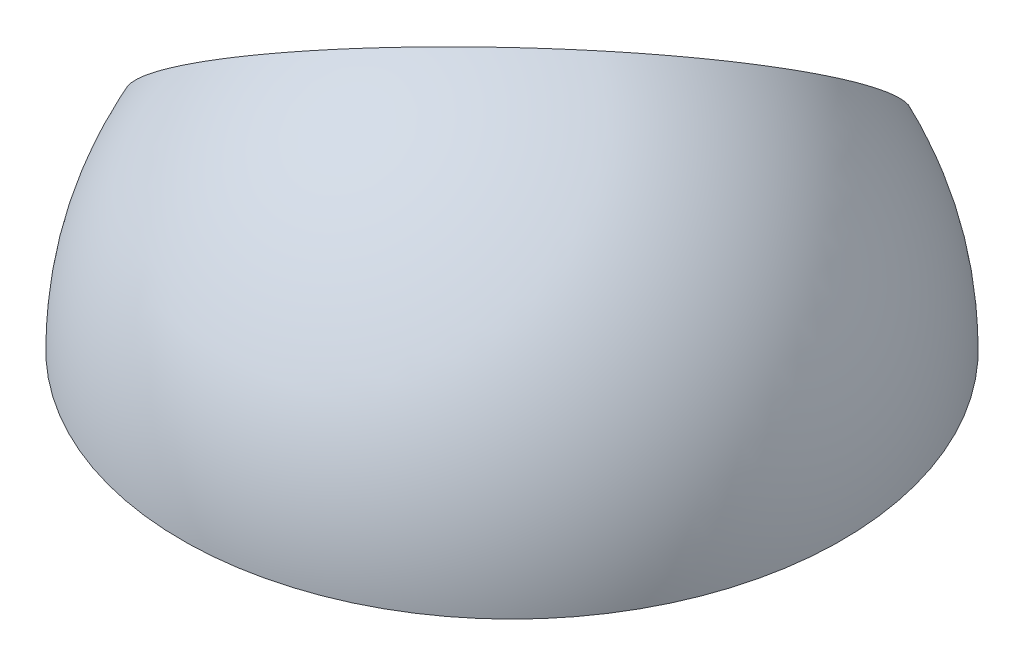
ISO-10303-21;
HEADER;
FILE_DESCRIPTION(('STEP AP214'),'2;1');
FILE_NAME('part.step','',(''),(''),'','','');
FILE_SCHEMA(('AUTOMOTIVE_DESIGN { 1 0 10303 214 1 1 1 1 }'));
ENDSEC;
DATA;
#1=APPLICATION_CONTEXT('core data for automotive mechanical design processes');
#2=APPLICATION_PROTOCOL_DEFINITION('international standard','automotive_design',2000,#1);
#3=PRODUCT_CONTEXT('',#1,'mechanical');
#4=PRODUCT('Part','Part','',(#3));
#5=PRODUCT_RELATED_PRODUCT_CATEGORY('part','',(#4));
#6=PRODUCT_DEFINITION_FORMATION('','',#4);
#7=PRODUCT_DEFINITION_CONTEXT('part definition',#1,'design');
#8=PRODUCT_DEFINITION('design','',#6,#7);
#9=PRODUCT_DEFINITION_SHAPE('','',#8);
#10=(LENGTH_UNIT() NAMED_UNIT(*) SI_UNIT(.MILLI.,.METRE.));
#11=(NAMED_UNIT(*) PLANE_ANGLE_UNIT() SI_UNIT($,.RADIAN.));
#12=(NAMED_UNIT(*) SI_UNIT($,.STERADIAN.) SOLID_ANGLE_UNIT());
#13=UNCERTAINTY_MEASURE_WITH_UNIT(LENGTH_MEASURE(1.E-05),#10,'distance_accuracy_value','');
#14=(GEOMETRIC_REPRESENTATION_CONTEXT(3) GLOBAL_UNCERTAINTY_ASSIGNED_CONTEXT((#13)) GLOBAL_UNIT_ASSIGNED_CONTEXT((#10,
#11,#12)) REPRESENTATION_CONTEXT('',''));
#15=CARTESIAN_POINT('',(0.,0.,0.));
#16=DIRECTION('',(0.,0.,1.));
#17=DIRECTION('',(1.,0.,0.));
#18=AXIS2_PLACEMENT_3D('',#15,#16,#17);
#19=CARTESIAN_POINT('',(0.383136407393772,0.,0.));
#20=DIRECTION('',(0.,-1.,0.));
#21=DIRECTION('',(0.,0.,-1.));
#22=AXIS2_PLACEMENT_3D('',#19,#20,#21);
#23=DEGENERATE_TOROIDAL_SURFACE('',#22,0.383136407393772,126.5,.F.);
#24=CARTESIAN_POINT('',(52.6351043958338,-86.6907653224554,75.4072090776001));
#25=CARTESIAN_POINT('',(52.581622733901,-86.6827571855285,75.4534362434314));
#26=CARTESIAN_POINT('',(52.531166621759,-86.6703634438254,75.5024869214113));
#27=CARTESIAN_POINT('',(52.4377720025849,-86.6371667200121,75.6048070686846));
#28=CARTESIAN_POINT('',(52.3948432248028,-86.6163529680348,75.6580818705379));
#29=CARTESIAN_POINT('',(52.3177802055877,-86.566937335142,75.767263155476));
#30=CARTESIAN_POINT('',(52.2836404150985,-86.5383403918402,75.823167951571));
#31=CARTESIAN_POINT('',(52.2250937386535,-86.4741757156623,75.9360374508192));
#32=CARTESIAN_POINT('',(52.2006843286383,-86.4386097941132,75.9930018750868));
#33=CARTESIAN_POINT('',(52.1622399213904,-86.3614249131837,76.1065129286236));
#34=CARTESIAN_POINT('',(52.1482261691941,-86.3197937650947,76.163058469791));
#35=CARTESIAN_POINT('',(52.1310734802749,-86.2317055372559,76.274004811861));
#36=CARTESIAN_POINT('',(52.1279349697599,-86.1852482684406,76.3284055286239));
#37=CARTESIAN_POINT('',(52.1326498073632,-86.0889286606633,76.4333845059061));
#38=CARTESIAN_POINT('',(52.1404797200166,-86.0390737974309,76.4839706735622));
#39=CARTESIAN_POINT('',(52.166904567311,-85.9372901270905,76.579983106816));
#40=CARTESIAN_POINT('',(52.185499158336,-85.8853613862314,76.6254095370607));
#41=CARTESIAN_POINT('',(52.232811607696,-85.7812436997956,76.7095113337155));
#42=CARTESIAN_POINT('',(52.2614668451432,-85.7290582890394,76.7482262972864));
#43=CARTESIAN_POINT('',(52.3281337932015,-85.6256153651508,76.8181040619493));
#44=CARTESIAN_POINT('',(52.3661450935455,-85.5743578114372,76.8492671940733));
#45=CARTESIAN_POINT('',(52.4501388079994,-85.4746304296657,76.9029154027146));
#46=CARTESIAN_POINT('',(52.4960600223091,-85.4261427479154,76.9254631174904));
#47=CARTESIAN_POINT('',(52.594764698033,-85.3329444627287,76.961540291468));
#48=CARTESIAN_POINT('',(52.6475479259937,-85.2882337308816,76.9750700573748));
#49=CARTESIAN_POINT('',(52.7581643214634,-85.2041080263957,76.9926653168734));
#50=CARTESIAN_POINT('',(52.8159686218697,-85.16466571053,76.9967816196108));
#51=CARTESIAN_POINT('',(52.9352232008162,-85.091914722377,76.9955847048775));
#52=CARTESIAN_POINT('',(52.9966734305711,-85.0586059680423,76.9902716135517));
#53=CARTESIAN_POINT('',(53.1214051252912,-84.9990891597076,76.9703910106702));
#54=CARTESIAN_POINT('',(53.1846846526629,-84.9728738767997,76.9558329716173));
#55=CARTESIAN_POINT('',(53.3113454621642,-84.9282195751147,76.9179056854184));
#56=CARTESIAN_POINT('',(53.3747267457106,-84.9097806655746,76.8945363145059));
#57=CARTESIAN_POINT('',(53.5000503658305,-84.8811158443466,76.8395665765968));
#58=CARTESIAN_POINT('',(53.5619863594799,-84.8709212329244,76.8079354383776));
#59=CARTESIAN_POINT('',(53.6824405950161,-84.8591154121405,76.7374017090566));
#60=CARTESIAN_POINT('',(53.7409587204694,-84.8575044950235,76.6984988704255));
#61=CARTESIAN_POINT('',(53.8533488532798,-84.8628975888673,76.6142401879801));
#62=CARTESIAN_POINT('',(53.9071859597254,-84.8699612092344,76.5688416091526));
#63=CARTESIAN_POINT('',(54.0082660151563,-84.8925766911129,76.4730886178395));
#64=CARTESIAN_POINT('',(54.0555087012011,-84.9081288909699,76.4227340078775));
#65=CARTESIAN_POINT('',(54.1424053818713,-84.9474052145417,76.3181161484495));
#66=CARTESIAN_POINT('',(54.1820035792274,-84.9711861281193,76.2638278656223));
#67=CARTESIAN_POINT('',(54.2520911760629,-85.0262141235401,76.1531936433854));
#68=CARTESIAN_POINT('',(54.2825803154896,-85.0574614184937,76.0968476452819));
#69=CARTESIAN_POINT('',(54.3336993019912,-85.126684920978,75.9834492363183));
#70=CARTESIAN_POINT('',(54.354287989118,-85.1646883353882,75.9263948709474));
#71=CARTESIAN_POINT('',(54.3848226238213,-85.2462641627574,75.8134293949179));
#72=CARTESIAN_POINT('',(54.394768518426,-85.2898366034337,75.7575182899509));
#73=CARTESIAN_POINT('',(54.4037076254924,-85.3812931855327,75.6484692775762));
#74=CARTESIAN_POINT('',(54.4027075411378,-85.4291746703318,75.5953296929567));
#75=CARTESIAN_POINT('',(54.3897645570242,-85.5279144116556,75.4933185712311));
#76=CARTESIAN_POINT('',(54.3778219152291,-85.5787725979801,75.4444469335407));
#77=CARTESIAN_POINT('',(54.3433864716294,-85.6817464572994,75.3526323884338));
#78=CARTESIAN_POINT('',(54.3209477942895,-85.7338543929559,75.3096605115631));
#79=CARTESIAN_POINT('',(54.2661455115765,-85.8380822167562,75.2306115879658));
#80=CARTESIAN_POINT('',(54.2337822845371,-85.8902021043687,75.1945342784965));
#81=CARTESIAN_POINT('',(54.1603057524317,-85.9925657285519,75.1305803958478));
#82=CARTESIAN_POINT('',(54.1192584375406,-86.0428204306116,75.1026455554771));
#83=CARTESIAN_POINT('',(54.0294292605486,-86.140404988703,75.0554493383793));
#84=CARTESIAN_POINT('',(53.9806476833784,-86.1877349523931,75.0361876422333));
#85=CARTESIAN_POINT('',(53.8770724971894,-86.2778138306508,75.0070011324767));
#86=CARTESIAN_POINT('',(53.8223187446435,-86.3205897540754,74.9970181998936));
#87=CARTESIAN_POINT('',(53.7081123948492,-86.4006750403695,74.9864706827597));
#88=CARTESIAN_POINT('',(53.6486600836574,-86.4379847356387,74.985905525281));
#89=CARTESIAN_POINT('',(53.5269151889142,-86.5059895533396,74.9941902579723));
#90=CARTESIAN_POINT('',(53.4646304995999,-86.5367018406845,75.0030153513888));
#91=CARTESIAN_POINT('',(53.3388246077606,-86.5907868685577,75.0297787664675));
#92=CARTESIAN_POINT('',(53.2753030931162,-86.6141577302618,75.0477194179217));
#93=CARTESIAN_POINT('',(53.1486584112798,-86.6529674581337,75.0922413176003));
#94=CARTESIAN_POINT('',(53.0855368754267,-86.6683837398467,75.1188468218));
#95=CARTESIAN_POINT('',(52.9616929023203,-86.6907647424415,75.179889071336));
#96=CARTESIAN_POINT('',(52.9009677326723,-86.6977393748702,75.2143165761238));
#97=CARTESIAN_POINT('',(52.8059666440767,-86.7020896194912,75.2755518399759));
#98=CARTESIAN_POINT('',(52.7704256880657,-86.7021094084581,75.300267819741));
#99=CARTESIAN_POINT('',(52.7012518587614,-86.698881565356,75.3520443560328));
#100=CARTESIAN_POINT('',(52.6676189865994,-86.6956339313498,75.3791049139497));
#101=CARTESIAN_POINT('',(52.6351043958338,-86.6907653224554,75.4072090776001));
#102=B_SPLINE_CURVE_WITH_KNOTS('',3,(#24,#25,#26,#27,#28,#29,#30,#31,#32,#33,#34,#35,#36,#37,
#38,#39,#40,#41,#42,#43,#44,#45,#46,#47,#48,#49,#50,#51,#52,#53,#54,#55,#56,#57,#58,#59,#60,#61,
#62,#63,#64,#65,#66,#67,#68,#69,#70,#71,#72,#73,#74,#75,#76,#77,#78,#79,#80,#81,#82,#83,#84,#85,
#86,#87,#88,#89,#90,#91,#92,#93,#94,#95,#96,#97,#98,#99,#100,#101),.UNSPECIFIED.,.T.,.F.,(4,2,2,
2,2,2,2,2,2,2,2,2,2,2,2,2,2,2,2,2,2,2,2,2,2,2,2,2,2,2,2,2,2,2,2,2,2,2,4),(0.,0.21327118278307,
0.426816023374861,0.640225706799427,0.853579995700118,1.06736911286691,1.28116660847857,
1.49450799399908,1.7078425698894,1.91987215560792,2.1318924454004,2.34234050424252,
2.55278140527523,2.76208374372617,2.97138328218022,3.18046871464576,3.38955708409669,
3.5994355990863,3.80932125966,4.02065731119173,4.23200178696178,4.44483493333587,
4.65767415526009,4.87139074061489,5.085108389687,5.29869516801402,5.51227691129867,
5.72476922717648,5.93725344364511,6.14817754195262,6.35909387160236,6.56868001107842,
6.77825340039088,6.98727474135398,7.19634953174848,7.40601470053955,7.61543345677379,
7.7450932479605,7.87475311602878),.UNSPECIFIED.);
#103=CARTESIAN_POINT('',(52.6351043958338,-86.6907653224554,75.4072090776001));
#104=VERTEX_POINT('',#103);
#105=EDGE_CURVE('E62',#104,#104,#102,.T.);
#106=ORIENTED_EDGE('',*,*,#105,.F.);
#107=EDGE_LOOP('',(#106));
#108=FACE_BOUND('',#107,.T.);
#109=CARTESIAN_POINT('',(0.383136407393772,-106.5199,0.));
#110=DIRECTION('',(0.,-1.,0.));
#111=DIRECTION('',(0.,0.,-1.));
#112=AXIS2_PLACEMENT_3D('',#109,#110,#111);
#113=CIRCLE('',#112,67.85);
#114=CARTESIAN_POINT('',(64.1556548973117,-106.5199,23.1665358966995));
#115=VERTEX_POINT('',#114);
#116=CARTESIAN_POINT('',(18.8305173700093,-106.5199,65.2940781053109));
#117=VERTEX_POINT('',#116);
#118=EDGE_CURVE('E46',#115,#117,#113,.T.);
#119=ORIENTED_EDGE('',*,*,#118,.T.);
#120=CARTESIAN_POINT('',(18.8305703125792,-106.5201,65.2937387010644));
#121=CARTESIAN_POINT('',(18.7515534812181,-106.221613020711,65.8002805778316));
#122=CARTESIAN_POINT('',(18.6835008607072,-105.917348223661,66.3050507679857));
#123=CARTESIAN_POINT('',(18.5694171298681,-105.297753250337,67.3102530381507));
#124=CARTESIAN_POINT('',(18.5233854907037,-104.982423339988,67.8106852220558));
#125=CARTESIAN_POINT('',(18.4184748896057,-104.020715496859,69.3040611116232));
#126=CARTESIAN_POINT('',(18.3927392067555,-103.358464277973,70.2893474489711));
#127=CARTESIAN_POINT('',(18.4299355264252,-101.997079056137,72.2313478041603));
#128=CARTESIAN_POINT('',(18.4928053164211,-101.297971262938,73.1880813882324));
#129=CARTESIAN_POINT('',(18.6531088963032,-100.225285871343,74.5969429181656));
#130=CARTESIAN_POINT('',(18.7175472389922,-99.8637047869944,75.0622088485828));
#131=CARTESIAN_POINT('',(18.868323016046,-99.1330194175186,75.9833844613894));
#132=CARTESIAN_POINT('',(18.9546660586361,-98.7639132280404,76.4392917153316));
#133=CARTESIAN_POINT('',(19.2463853553708,-97.6462084333593,77.7918219560409));
#134=CARTESIAN_POINT('',(19.4844392042847,-96.8873076608126,78.6731430306269));
#135=CARTESIAN_POINT('',(20.0459721582301,-95.3477374437189,80.3882863841069));
#136=CARTESIAN_POINT('',(20.3694512704607,-94.5670679973375,81.2221086589981));
#137=CARTESIAN_POINT('',(20.9168614468943,-93.3841273363138,82.4325786058129));
#138=CARTESIAN_POINT('',(21.1097142963535,-92.9877928609099,82.8293875094791));
#139=CARTESIAN_POINT('',(21.51579243788,-92.1918584330762,83.6088789427077));
#140=CARTESIAN_POINT('',(21.7290124993607,-91.7922593430236,83.9915650643866));
#141=CARTESIAN_POINT('',(22.1755037884263,-90.9903902101935,84.7422440201355));
#142=CARTESIAN_POINT('',(22.4087768212013,-90.5881199299667,85.1102355270042));
#143=CARTESIAN_POINT('',(22.894935409498,-89.781658924048,85.830840353806));
#144=CARTESIAN_POINT('',(23.1478222769538,-89.377468071593,86.183452642582));
#145=CARTESIAN_POINT('',(23.9352470536739,-88.1631031622027,87.2172459360309));
#146=CARTESIAN_POINT('',(24.4986415138755,-87.350970888294,87.8745386262688));
#147=CARTESIAN_POINT('',(25.6980759169696,-85.7277728729418,89.120264134024));
#148=CARTESIAN_POINT('',(26.3341159901502,-84.9167071334139,89.7086968280389));
#149=CARTESIAN_POINT('',(27.674502755365,-83.3011426857675,90.8127177957361));
#150=CARTESIAN_POINT('',(28.3788597261383,-82.4966449856581,91.3282950790693));
#151=CARTESIAN_POINT('',(29.8507662171092,-80.9000947814035,92.2827891517283));
#152=CARTESIAN_POINT('',(30.6183157000251,-80.1080422699163,92.7217059862809));
#153=CARTESIAN_POINT('',(32.2109839120175,-78.5421658665004,93.5196716557136));
#154=CARTESIAN_POINT('',(33.0360904550291,-77.7683381621179,93.8787373297822));
#155=CARTESIAN_POINT('',(34.738145612156,-76.2442383392648,94.5145519212246));
#156=CARTESIAN_POINT('',(35.6150942250775,-75.4939662202517,94.7913008404941));
#157=CARTESIAN_POINT('',(37.4145372304988,-74.0223544852373,95.2604881287252));
#158=CARTESIAN_POINT('',(38.3370287289785,-73.301013036104,95.4529318472029));
#159=CARTESIAN_POINT('',(40.2210447063707,-71.8923379451355,95.7521541518888));
#160=CARTESIAN_POINT('',(41.182569175817,-71.2050042950526,95.8589327588726));
#161=CARTESIAN_POINT('',(43.1375810388047,-69.8693844754448,95.9860395326746));
#162=CARTESIAN_POINT('',(44.1310609574219,-69.221089274611,96.0063877709695));
#163=CARTESIAN_POINT('',(46.143127696901,-67.9679788248445,95.960533281822));
#164=CARTESIAN_POINT('',(47.1617145153575,-67.3631635717462,95.8943305626714));
#165=CARTESIAN_POINT('',(49.2167672570864,-66.2012991228329,95.6758325875251));
#166=CARTESIAN_POINT('',(50.2532335330465,-65.6442508705606,95.5235356313585));
#167=CARTESIAN_POINT('',(52.3366488195096,-64.5818927951125,95.1339216831798));
#168=CARTESIAN_POINT('',(53.3835978283751,-64.0765829638541,94.8966047044492));
#169=CARTESIAN_POINT('',(55.4802458967218,-63.1214212240257,94.3387049417055));
#170=CARTESIAN_POINT('',(56.52994414649,-62.6715545306455,94.0181444270824));
#171=CARTESIAN_POINT('',(58.6249007997118,-61.8303181777239,93.2959993146596));
#172=CARTESIAN_POINT('',(59.6701592039607,-61.4389485077044,92.8944147313733));
#173=CARTESIAN_POINT('',(61.7487912583257,-60.7174898480722,92.0130738314381));
#174=CARTESIAN_POINT('',(62.7821649918178,-60.3874004283068,91.5333180635514));
#175=CARTESIAN_POINT('',(64.8296817526455,-59.7908447932231,90.4990393822191));
#176=CARTESIAN_POINT('',(65.8438247821239,-59.5243785708157,89.9445164771044));
#177=CARTESIAN_POINT('',(67.8454581537493,-59.0570111451175,88.764764375248));
#178=CARTESIAN_POINT('',(68.8329539149151,-58.8560965175914,88.139549690753));
#179=CARTESIAN_POINT('',(70.7744846924331,-58.5211850165275,86.8227644128879));
#180=CARTESIAN_POINT('',(71.7285197135459,-58.387188133469,86.1311938289586));
#181=CARTESIAN_POINT('',(73.5963445019408,-58.1870640907538,84.6866112858118));
#182=CARTESIAN_POINT('',(74.5101342165577,-58.1209370199092,83.9335992461957));
#183=CARTESIAN_POINT('',(76.2909681035049,-58.057022796083,82.3714882747144));
#184=CARTESIAN_POINT('',(77.1580122776242,-58.0592356404858,81.5623893449959));
#185=CARTESIAN_POINT('',(78.8390972132591,-58.1319815154998,79.8939498028932));
#186=CARTESIAN_POINT('',(79.6531437725723,-58.2025070594355,79.0346147057987));
#187=CARTESIAN_POINT('',(81.2225507828027,-58.4113663000296,77.271732940855));
#188=CARTESIAN_POINT('',(81.9779112392176,-58.5496999903358,76.3681862771474));
#189=CARTESIAN_POINT('',(83.4245766252885,-58.8931924519208,74.5233087900822));
#190=CARTESIAN_POINT('',(84.1158816849562,-59.0983510875628,73.5819780434196));
#191=CARTESIAN_POINT('',(85.4295267936916,-59.5740361646861,71.6682252928996));
#192=CARTESIAN_POINT('',(86.0518668402191,-59.8445626085751,70.695803287897));
#193=CARTESIAN_POINT('',(87.2231683673103,-60.4490648602593,68.726773817526));
#194=CARTESIAN_POINT('',(87.7721290913368,-60.7830413221351,67.7301661029292));
#195=CARTESIAN_POINT('',(88.7927677990553,-61.5120697173853,65.7198628724624));
#196=CARTESIAN_POINT('',(89.2644457841037,-61.9071216496876,64.7061673568923));
#197=CARTESIAN_POINT('',(90.1271753827554,-62.7554976485102,62.6688923732875));
#198=CARTESIAN_POINT('',(90.5182265792762,-63.2088220164541,61.6453128541516));
#199=CARTESIAN_POINT('',(91.2169280135987,-64.1705223170932,59.5955539302741));
#200=CARTESIAN_POINT('',(91.5245782415252,-64.6788982563068,58.5693745252247));
#201=CARTESIAN_POINT('',(92.054335778741,-65.7471644029332,56.5215743527943));
#202=CARTESIAN_POINT('',(92.2764315419007,-66.3070615508442,55.4999542190926));
#203=CARTESIAN_POINT('',(92.6334521436676,-67.4743362140084,53.4686774434928));
#204=CARTESIAN_POINT('',(92.7683769772343,-68.0817137320071,52.4590208022864));
#205=CARTESIAN_POINT('',(92.9501057381304,-69.339628897505,50.4588631306323));
#206=CARTESIAN_POINT('',(92.9969108005221,-69.990165988958,49.4683618536088));
#207=CARTESIAN_POINT('',(93.0020814245798,-71.3297896407367,47.5135432086282));
#208=CARTESIAN_POINT('',(92.9604469766841,-72.0188762052302,46.5492258435019));
#209=CARTESIAN_POINT('',(92.7890268130013,-73.4308592261215,44.6534268362343));
#210=CARTESIAN_POINT('',(92.6592222716703,-74.1537628722386,43.7219522511714));
#211=CARTESIAN_POINT('',(92.3123759177088,-75.6281118309389,41.8986779487401));
#212=CARTESIAN_POINT('',(92.0953340805544,-76.3795571515456,41.0068782425252));
#213=CARTESIAN_POINT('',(91.5755585336196,-77.9056780981322,39.269267711955));
#214=CARTESIAN_POINT('',(91.272822313561,-78.6803544040318,38.4234582356743));
#215=CARTESIAN_POINT('',(90.5838222745495,-80.2474178251363,36.7838684088315));
#216=CARTESIAN_POINT('',(90.1975584937737,-81.0398049322462,35.9900880344893));
#217=CARTESIAN_POINT('',(89.3441492213531,-82.6368695383373,34.4600029900306));
#218=CARTESIAN_POINT('',(88.8769832949624,-83.4415500955368,33.7237129094923));
#219=CARTESIAN_POINT('',(87.865164709796,-85.0572953612574,32.3140632215429));
#220=CARTESIAN_POINT('',(87.3205118224999,-85.8683600885996,31.6407037997331));
#221=CARTESIAN_POINT('',(86.1576010025789,-87.4911111709522,30.3617056972529));
#222=CARTESIAN_POINT('',(85.5393433156724,-88.3027975238784,29.756066790521));
#223=CARTESIAN_POINT('',(84.2336286819503,-89.9210237306316,28.6168174658373));
#224=CARTESIAN_POINT('',(83.5461725337294,-90.7275636437377,28.0832062168065));
#225=CARTESIAN_POINT('',(82.1066618585461,-92.3300968939764,27.0915993888036));
#226=CARTESIAN_POINT('',(81.3545819186346,-93.126085938699,26.6336337658479));
#227=CARTESIAN_POINT('',(79.7913649290601,-94.701578769997,25.7968096268589));
#228=CARTESIAN_POINT('',(78.9802250657736,-95.4810817688888,25.4179548830097));
#229=CARTESIAN_POINT('',(77.3049302850246,-97.017807474651,24.7421636461495));
#230=CARTESIAN_POINT('',(76.4407891510888,-97.7750358990966,24.4452059644547));
#231=CARTESIAN_POINT('',(74.6655197175494,-99.2619675948406,23.9352271008568));
#232=CARTESIAN_POINT('',(73.7544001528719,-99.9916759397047,23.7221903783164));
#233=CARTESIAN_POINT('',(72.1370277205062,-101.230485944107,23.4263705489833));
#234=CARTESIAN_POINT('',(71.4399964725605,-101.747086162831,23.3240609743076));
#235=CARTESIAN_POINT('',(70.0266929862424,-102.76054171563,23.1661512038662));
#236=CARTESIAN_POINT('',(69.3104242286522,-103.257400581848,23.1105426161307));
#237=CARTESIAN_POINT('',(67.8621655308296,-104.228947742047,23.0462788876022));
#238=CARTESIAN_POINT('',(67.130194791465,-104.703661085903,23.0375693543322));
#239=CARTESIAN_POINT('',(65.6524049847231,-105.629814841323,23.066953454164));
#240=CARTESIAN_POINT('',(64.9065833317758,-106.081250847053,23.1050559140021));
#241=CARTESIAN_POINT('',(64.1553125329895,-106.5201,23.166563911272));
#242=B_SPLINE_CURVE_WITH_KNOTS('',3,(#120,#121,#122,#123,#124,#125,#126,#127,#128,#129,#130,
#131,#132,#133,#134,#135,#136,#137,#138,#139,#140,#141,#142,#143,#144,#145,#146,#147,#148,#149,
#150,#151,#152,#153,#154,#155,#156,#157,#158,#159,#160,#161,#162,#163,#164,#165,#166,#167,#168,
#169,#170,#171,#172,#173,#174,#175,#176,#177,#178,#179,#180,#181,#182,#183,#184,#185,#186,#187,
#188,#189,#190,#191,#192,#193,#194,#195,#196,#197,#198,#199,#200,#201,#202,#203,#204,#205,#206,
#207,#208,#209,#210,#211,#212,#213,#214,#215,#216,#217,#218,#219,#220,#221,#222,#223,#224,#225,
#226,#227,#228,#229,#230,#231,#232,#233,#234,#235,#236,#237,#238,#239,#240,#241),.UNSPECIFIED.,
.F.,.F.,(4,2,2,2,2,2,2,2,2,2,2,2,2,2,2,2,2,2,2,2,2,2,2,2,2,2,2,2,2,2,2,2,2,2,2,2,2,2,2,2,2,2,2,
2,2,2,2,2,2,2,2,2,2,2,2,2,2,2,2,2,4),(0.,1.77942859194962,3.55881444858677,7.11666408491391,
10.6720168939068,12.4498392710294,14.2281172813581,17.7850899057427,21.3420628298836,
23.1208279217879,24.8991374236835,26.6776071789035,28.456195995524,32.0126402070852,
35.5690907971385,39.126077311735,42.6830617278315,46.2392953264203,49.7955288431172,
53.3515366692917,56.90754363306,60.4627247503628,64.0179055270644,67.5731565131759,
71.1284069438993,74.6827072487067,78.2370069168516,81.7912816348738,85.3455559568665,
88.8991019455875,92.4526474287211,96.006197561894,99.5597475590652,103.11290815184,
106.66606841176,110.219221459757,113.772374638628,117.325564447507,120.87875419402,
124.431962320726,127.985170868157,131.538858776255,135.092546889843,138.646189228405,
142.199831951166,145.754233664781,149.308636377603,152.863143221669,156.417648441118,
159.973052791686,163.528467627877,167.08387059519,170.639232535569,174.195999057594,
177.752935135513,181.308950085772,184.864306216742,187.483563780614,190.1023505742,
192.718099502087,195.334341723865),.UNSPECIFIED.);
#243=EDGE_CURVE('E11',#117,#115,#242,.T.);
#244=ORIENTED_EDGE('',*,*,#243,.T.);
#245=EDGE_LOOP('',(#119,#244));
#246=FACE_BOUND('',#245,.T.);
#247=CARTESIAN_POINT('',(71.7627559158137,-86.6923553025683,57.6297729409005));
#248=CARTESIAN_POINT('',(71.7135696442419,-86.6996877122158,57.6797101978784));
#249=CARTESIAN_POINT('',(71.6669074125769,-86.7027193340757,57.7328344544197));
#250=CARTESIAN_POINT('',(71.5800058061071,-86.700040680785,57.8439672658024));
#251=CARTESIAN_POINT('',(71.53977372394,-86.6943205566203,57.901981253986));
#252=CARTESIAN_POINT('',(71.4669487212025,-86.6742566815171,58.0212208368308));
#253=CARTESIAN_POINT('',(71.4343545841034,-86.6599143051815,58.0824459181436));
#254=CARTESIAN_POINT('',(71.3777737604278,-86.6229896178934,58.2063520103543));
#255=CARTESIAN_POINT('',(71.3537848972593,-86.600409393516,58.2690326488111));
#256=CARTESIAN_POINT('',(71.3152207123575,-86.5477736611709,58.3937359702637));
#257=CARTESIAN_POINT('',(71.300597048806,-86.5177576689535,58.4557603797687));
#258=CARTESIAN_POINT('',(71.2810043147365,-86.4510364659745,58.5777027691688));
#259=CARTESIAN_POINT('',(71.2760352954641,-86.4143312197083,58.6376207378814));
#260=CARTESIAN_POINT('',(71.2759033758777,-86.3354828989874,58.7533300063382));
#261=CARTESIAN_POINT('',(71.2806908897117,-86.2933683357759,58.8091406868666));
#262=CARTESIAN_POINT('',(71.2998315761797,-86.2047582955592,58.9153832815107));
#263=CARTESIAN_POINT('',(71.3141846258985,-86.1582628748538,58.9658152647318));
#264=CARTESIAN_POINT('',(71.3520220645719,-86.0622448875427,59.0598521104082));
#265=CARTESIAN_POINT('',(71.3755012037026,-86.0127240750859,59.1034608777571));
#266=CARTESIAN_POINT('',(71.4309041786078,-85.9120350222002,59.1826758156784));
#267=CARTESIAN_POINT('',(71.4628281358573,-85.8608667580828,59.2182818711216));
#268=CARTESIAN_POINT('',(71.5343450993195,-85.7581095569175,59.2806495998491));
#269=CARTESIAN_POINT('',(71.5739691853761,-85.7065197552515,59.3073741987296));
#270=CARTESIAN_POINT('',(71.6596619167565,-85.6045752833283,59.351061972417));
#271=CARTESIAN_POINT('',(71.7057307941325,-85.5542206576216,59.3680247956273));
#272=CARTESIAN_POINT('',(71.8033496448949,-85.4557979880524,59.3918356173086));
#273=CARTESIAN_POINT('',(71.8549358203425,-85.4077484744315,59.3986117843545));
#274=CARTESIAN_POINT('',(71.9618576088669,-85.3156547835717,59.4016657085339));
#275=CARTESIAN_POINT('',(72.0171933682269,-85.2716107627571,59.3979430558444));
#276=CARTESIAN_POINT('',(72.1304524387584,-85.1884603392645,59.380065671967));
#277=CARTESIAN_POINT('',(72.1883909502348,-85.149390044532,59.3658392462951));
#278=CARTESIAN_POINT('',(72.3048616289135,-85.0776388456609,59.32728613415));
#279=CARTESIAN_POINT('',(72.3633938122241,-85.0449581153841,59.3029591728949));
#280=CARTESIAN_POINT('',(72.4796234002521,-84.9867964454077,59.2447795629637));
#281=CARTESIAN_POINT('',(72.5373168208011,-84.9613431433987,59.2108913105745));
#282=CARTESIAN_POINT('',(72.6500004922966,-84.9185345165218,59.1345783564852));
#283=CARTESIAN_POINT('',(72.7049907370458,-84.9011792102185,59.0921536352157));
#284=CARTESIAN_POINT('',(72.8106386038668,-84.8750947969829,59.0000048609012));
#285=CARTESIAN_POINT('',(72.8613005791075,-84.8663569274879,58.9502882817487));
#286=CARTESIAN_POINT('',(72.9568880275061,-84.857756014387,58.8449247235324));
#287=CARTESIAN_POINT('',(73.0018136410206,-84.8578927535965,58.7892778896304));
#288=CARTESIAN_POINT('',(73.0843864188824,-84.8670457715447,58.6739509461899));
#289=CARTESIAN_POINT('',(73.1220715899419,-84.8760140796331,58.6142942479506));
#290=CARTESIAN_POINT('',(73.1893516548437,-84.9025354072515,58.492382784544));
#291=CARTESIAN_POINT('',(73.2189468792791,-84.9200880759026,58.4301281256614));
#292=CARTESIAN_POINT('',(73.2689757936642,-84.9631385083782,58.3052814860817));
#293=CARTESIAN_POINT('',(73.2894757372671,-84.988576443071,58.2426954220255));
#294=CARTESIAN_POINT('',(73.3210204093937,-85.0467288671631,58.1185292288434));
#295=CARTESIAN_POINT('',(73.3320654960172,-85.0794430809166,58.0569490617061));
#296=CARTESIAN_POINT('',(73.3443299054669,-85.1509962092966,57.936940902954));
#297=CARTESIAN_POINT('',(73.345608938988,-85.1897964217195,57.8784959287731));
#298=CARTESIAN_POINT('',(73.3384589567054,-85.2725594783594,57.7660232268024));
#299=CARTESIAN_POINT('',(73.3300301330894,-85.3165222203575,57.7119954115882));
#300=CARTESIAN_POINT('',(73.303741973491,-85.408255187518,57.6100005624519));
#301=CARTESIAN_POINT('',(73.2859027118625,-85.4560171247557,57.5620208955235));
#302=CARTESIAN_POINT('',(73.2413300787158,-85.5540717100564,57.4733311186303));
#303=CARTESIAN_POINT('',(73.2145966202028,-85.6043643828686,57.4326210797763));
#304=CARTESIAN_POINT('',(73.1529280399708,-85.7062002894116,57.359491367527));
#305=CARTESIAN_POINT('',(73.1179703557784,-85.7577466072161,57.3270950226125));
#306=CARTESIAN_POINT('',(73.0409040485358,-85.8605044553986,57.2716183409876));
#307=CARTESIAN_POINT('',(72.9987951910586,-85.9117159747441,57.2485383097649));
#308=CARTESIAN_POINT('',(72.9083342491589,-86.0127043331662,57.2121848375524));
#309=CARTESIAN_POINT('',(72.8599435834289,-86.0624697643726,57.1989757233014));
#310=CARTESIAN_POINT('',(72.7585115359603,-86.1588285699154,57.18294371645));
#311=CARTESIAN_POINT('',(72.7054701487455,-86.2054219405166,57.1801208360797));
#312=CARTESIAN_POINT('',(72.5958306327157,-86.2944708134831,57.184925627066));
#313=CARTESIAN_POINT('',(72.5392096378614,-86.3368940954588,57.1926287156496));
#314=CARTESIAN_POINT('',(72.4243402930034,-86.4160452059684,57.2183862619621));
#315=CARTESIAN_POINT('',(72.3660914957359,-86.4527714506293,57.2364435918157));
#316=CARTESIAN_POINT('',(72.2493022739317,-86.5196709784646,57.282517507405));
#317=CARTESIAN_POINT('',(72.1907619985705,-86.5498072874889,57.3105880728836));
#318=CARTESIAN_POINT('',(72.0754137565147,-86.6023861866285,57.3758626172618));
#319=CARTESIAN_POINT('',(72.0186038340866,-86.6248377804814,57.4130558193403));
#320=CARTESIAN_POINT('',(71.9284208381608,-86.6547638988521,57.480469832002));
#321=CARTESIAN_POINT('',(71.8940443202486,-86.6647152934977,57.5083001028725));
#322=CARTESIAN_POINT('',(71.8270163747212,-86.6811549502956,57.5669058320055));
#323=CARTESIAN_POINT('',(71.7943649495311,-86.6876432075798,57.5976812944079));
#324=CARTESIAN_POINT('',(71.7627559158137,-86.6923553025683,57.6297729409005));
#325=B_SPLINE_CURVE_WITH_KNOTS('',3,(#247,#248,#249,#250,#251,#252,#253,#254,#255,#256,#257,
#258,#259,#260,#261,#262,#263,#264,#265,#266,#267,#268,#269,#270,#271,#272,#273,#274,#275,#276,
#277,#278,#279,#280,#281,#282,#283,#284,#285,#286,#287,#288,#289,#290,#291,#292,#293,#294,#295,
#296,#297,#298,#299,#300,#301,#302,#303,#304,#305,#306,#307,#308,#309,#310,#311,#312,#313,#314,
#315,#316,#317,#318,#319,#320,#321,#322,#323,#324),.UNSPECIFIED.,.T.,.F.,(4,2,2,2,2,2,2,2,2,2,2,
2,2,2,2,2,2,2,2,2,2,2,2,2,2,2,2,2,2,2,2,2,2,2,2,2,2,2,4),(0.,0.211262490970079,
0.422762906836507,0.63422961318411,0.845642794007053,1.05595570206425,1.26626972643116,
1.47551753291786,1.68476265066348,1.8938875769383,2.10301551154818,2.3130057663218,
2.52300358398524,2.73447537174017,2.94595541444248,3.15889243617999,3.37183525118215,
3.5855817182831,3.7993286753952,4.01285806105945,4.22638222111255,4.43875293838333,
4.6511149758941,4.8619036127652,5.0726842657292,5.28217514322015,5.49166187346314,
5.70070352288212,5.90974721701033,6.11937123380121,6.32900212373539,6.53998749889708,
6.75097312250166,6.96347838390782,7.17604261989686,7.38977051652785,7.603247136389,
7.73901253596032,7.87477812637628),.UNSPECIFIED.);
#326=CARTESIAN_POINT('',(71.7627559158137,-86.6923553025683,57.6297729409005));
#327=VERTEX_POINT('',#326);
#328=EDGE_CURVE('E38',#327,#327,#325,.T.);
#329=ORIENTED_EDGE('',*,*,#328,.F.);
#330=EDGE_LOOP('',(#329));
#331=FACE_BOUND('',#330,.T.);
#332=ADVANCED_FACE('F34',(#108,#246,#331),#23,.T.);
#333=CARTESIAN_POINT('',(0.383136407393772,-106.5199,0.));
#334=DIRECTION('',(0.,-1.,0.));
#335=DIRECTION('',(0.,0.,-1.));
#336=AXIS2_PLACEMENT_3D('',#333,#334,#335);
#337=PLANE('',#336);
#338=ORIENTED_EDGE('',*,*,#118,.F.);
#339=CARTESIAN_POINT('',(68.2331364073938,-106.5199,73.));
#340=DIRECTION('',(0.,1.,0.));
#341=DIRECTION('',(0.,0.,1.));
#342=AXIS2_PLACEMENT_3D('',#339,#340,#341);
#343=CIRCLE('',#342,50.);
#344=EDGE_CURVE('E57',#117,#115,#343,.T.);
#345=ORIENTED_EDGE('',*,*,#344,.F.);
#346=EDGE_LOOP('',(#338,#345));
#347=FACE_BOUND('',#346,.T.);
#348=ADVANCED_FACE('F61',(#347),#337,.T.);
#349=CARTESIAN_POINT('',(68.2331364073938,-106.5199,73.));
#350=DIRECTION('',(0.,1.,0.));
#351=DIRECTION('',(1.,0.,0.));
#352=AXIS2_PLACEMENT_3D('',#349,#350,#351);
#353=SPHERICAL_SURFACE('',#352,50.);
#354=ORIENTED_EDGE('',*,*,#243,.F.);
#355=ORIENTED_EDGE('',*,*,#344,.T.);
#356=EDGE_LOOP('',(#354,#355));
#357=FACE_BOUND('',#356,.T.);
#358=ADVANCED_FACE('F60',(#357),#353,.T.);
#359=CARTESIAN_POINT('',(54.9960531066429,-88.4878525455378,77.853441113199));
#360=DIRECTION('',(-0.465942360113655,0.729100369487065,-0.501308655685838));
#361=DIRECTION('',(0.,0.566568845645395,0.82401440712165));
#362=AXIS2_PLACEMENT_3D('',#359,#360,#361);
#363=CYLINDRICAL_SURFACE('',#362,1.25);
#364=CARTESIAN_POINT('',(54.9960531066429,-88.4878525455378,77.853441113199));
#365=DIRECTION('',(0.465942360113656,-0.729100369487065,0.501308655685838));
#366=DIRECTION('',(0.,-0.566568845645395,-0.82401440712165));
#367=AXIS2_PLACEMENT_3D('',#364,#365,#366);
#368=CIRCLE('',#367,1.25);
#369=CARTESIAN_POINT('',(54.9960531066429,-89.1960636025946,76.823423104297));
#370=VERTEX_POINT('',#369);
#371=EDGE_CURVE('E65',#370,#370,#368,.T.);
#372=ORIENTED_EDGE('',*,*,#371,.T.);
#373=EDGE_LOOP('',(#372));
#374=FACE_BOUND('',#373,.T.);
#375=ORIENTED_EDGE('',*,*,#105,.T.);
#376=EDGE_LOOP('',(#375));
#377=FACE_BOUND('',#376,.T.);
#378=ADVANCED_FACE('F75',(#374,#377),#363,.F.);
#379=CARTESIAN_POINT('',(54.9960531066429,-88.4878525455378,77.853441113199));
#380=DIRECTION('',(0.465942360113656,-0.729100369487065,0.501308655685838));
#381=DIRECTION('',(0.,-0.566568845645395,-0.82401440712165));
#382=AXIS2_PLACEMENT_3D('',#379,#380,#381);
#383=PLANE('',#382);
#384=ORIENTED_EDGE('',*,*,#371,.F.);
#385=EDGE_LOOP('',(#384));
#386=FACE_BOUND('',#385,.T.);
#387=ADVANCED_FACE('F80',(#386),#383,.F.);
#388=CARTESIAN_POINT('',(74.0403192942299,-88.4878525455378,60.1527087730858));
#389=DIRECTION('',(-0.465942360113655,0.729100369487065,-0.501308655685838));
#390=DIRECTION('',(0.,0.566568845645395,0.82401440712165));
#391=AXIS2_PLACEMENT_3D('',#388,#389,#390);
#392=CYLINDRICAL_SURFACE('',#391,1.25000000000001);
#393=CARTESIAN_POINT('',(74.0403192942299,-88.4878525455378,60.1527087730858));
#394=DIRECTION('',(0.465942360113656,-0.729100369487065,0.501308655685838));
#395=DIRECTION('',(0.,-0.566568845645395,-0.82401440712165));
#396=AXIS2_PLACEMENT_3D('',#393,#394,#395);
#397=CIRCLE('',#396,1.25000000000001);
#398=CARTESIAN_POINT('',(74.0403192942299,-89.1960636025946,59.1226907641837));
#399=VERTEX_POINT('',#398);
#400=EDGE_CURVE('E146',#399,#399,#397,.T.);
#401=ORIENTED_EDGE('',*,*,#400,.T.);
#402=EDGE_LOOP('',(#401));
#403=FACE_BOUND('',#402,.T.);
#404=ORIENTED_EDGE('',*,*,#328,.T.);
#405=EDGE_LOOP('',(#404));
#406=FACE_BOUND('',#405,.T.);
#407=ADVANCED_FACE('F121',(#403,#406),#392,.F.);
#408=CARTESIAN_POINT('',(74.0403192942299,-88.4878525455378,60.1527087730858));
#409=DIRECTION('',(0.465942360113656,-0.729100369487065,0.501308655685838));
#410=DIRECTION('',(0.,-0.566568845645395,-0.82401440712165));
#411=AXIS2_PLACEMENT_3D('',#408,#409,#410);
#412=PLANE('',#411);
#413=ORIENTED_EDGE('',*,*,#400,.F.);
#414=EDGE_LOOP('',(#413));
#415=FACE_BOUND('',#414,.T.);
#416=ADVANCED_FACE('F129',(#415),#412,.F.);
#417=CLOSED_SHELL('',(#332,#348,#358,#378,#387,#407,#416));
#418=MANIFOLD_SOLID_BREP('B2',#417);
#419=ADVANCED_BREP_SHAPE_REPRESENTATION('',(#18,#418),#14);
#420=SHAPE_DEFINITION_REPRESENTATION(#9,#419);
ENDSEC;
END-ISO-10303-21;
